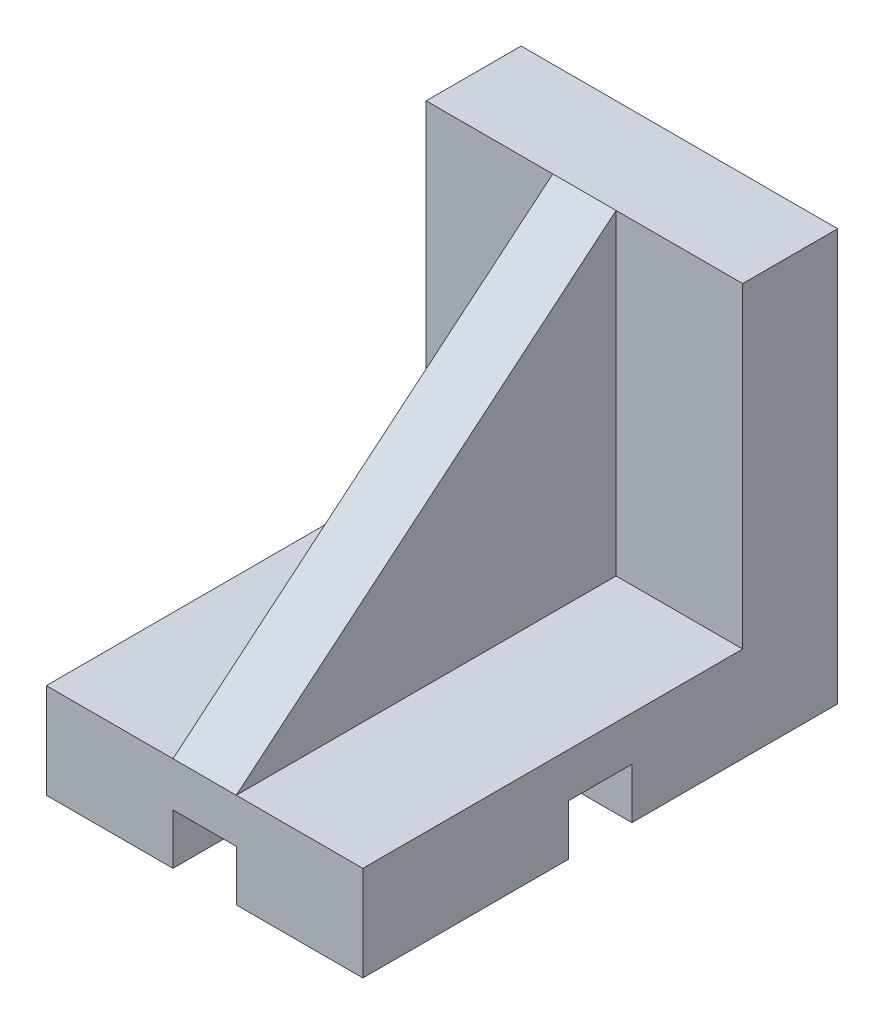
ISO-10303-21;
HEADER;
FILE_DESCRIPTION(('STEP AP214'),'2;1');
FILE_NAME('part.step','',(''),(''),'','','');
FILE_SCHEMA(('AUTOMOTIVE_DESIGN { 1 0 10303 214 1 1 1 1 }'));
ENDSEC;
DATA;
#1=APPLICATION_CONTEXT('core data for automotive mechanical design processes');
#2=APPLICATION_PROTOCOL_DEFINITION('international standard','automotive_design',2000,#1);
#3=PRODUCT_CONTEXT('',#1,'mechanical');
#4=PRODUCT('Part','Part','',(#3));
#5=PRODUCT_RELATED_PRODUCT_CATEGORY('part','',(#4));
#6=PRODUCT_DEFINITION_FORMATION('','',#4);
#7=PRODUCT_DEFINITION_CONTEXT('part definition',#1,'design');
#8=PRODUCT_DEFINITION('design','',#6,#7);
#9=PRODUCT_DEFINITION_SHAPE('','',#8);
#10=(LENGTH_UNIT() NAMED_UNIT(*) SI_UNIT(.MILLI.,.METRE.));
#11=(NAMED_UNIT(*) PLANE_ANGLE_UNIT() SI_UNIT($,.RADIAN.));
#12=(NAMED_UNIT(*) SI_UNIT($,.STERADIAN.) SOLID_ANGLE_UNIT());
#13=UNCERTAINTY_MEASURE_WITH_UNIT(LENGTH_MEASURE(1.E-05),#10,'distance_accuracy_value','');
#14=(GEOMETRIC_REPRESENTATION_CONTEXT(3) GLOBAL_UNCERTAINTY_ASSIGNED_CONTEXT((#13)) GLOBAL_UNIT_ASSIGNED_CONTEXT((#10,
#11,#12)) REPRESENTATION_CONTEXT('',''));
#15=CARTESIAN_POINT('',(0.,0.,0.));
#16=DIRECTION('',(0.,0.,1.));
#17=DIRECTION('',(1.,0.,0.));
#18=AXIS2_PLACEMENT_3D('',#15,#16,#17);
#19=CARTESIAN_POINT('',(0.,0.,0.));
#20=DIRECTION('',(0.,1.,0.));
#21=DIRECTION('',(0.,0.,1.));
#22=AXIS2_PLACEMENT_3D('',#19,#20,#21);
#23=PLANE('',#22);
#24=DIRECTION('',(0.,0.,1.));
#25=VECTOR('',#24,1.);
#26=CARTESIAN_POINT('',(-25.,0.,-37.5));
#27=LINE('',#26,#25);
#28=CARTESIAN_POINT('',(-25.,0.,4.99999999999999));
#29=VERTEX_POINT('',#28);
#30=CARTESIAN_POINT('',(-25.,0.,37.5));
#31=VERTEX_POINT('',#30);
#32=EDGE_CURVE('E192',#29,#31,#27,.T.);
#33=ORIENTED_EDGE('',*,*,#32,.F.);
#34=DIRECTION('',(1.,0.,0.));
#35=VECTOR('',#34,1.);
#36=CARTESIAN_POINT('',(-25.,0.,4.99999999999999));
#37=LINE('',#36,#35);
#38=CARTESIAN_POINT('',(-5.,0.,4.99999999999999));
#39=VERTEX_POINT('',#38);
#40=EDGE_CURVE('E176',#29,#39,#37,.T.);
#41=ORIENTED_EDGE('',*,*,#40,.T.);
#42=DIRECTION('',(0.,0.,1.));
#43=VECTOR('',#42,1.);
#44=CARTESIAN_POINT('',(-5.,0.,-37.5));
#45=LINE('',#44,#43);
#46=CARTESIAN_POINT('',(-5.,0.,37.5));
#47=VERTEX_POINT('',#46);
#48=EDGE_CURVE('E253',#39,#47,#45,.T.);
#49=ORIENTED_EDGE('',*,*,#48,.T.);
#50=DIRECTION('',(1.,0.,0.));
#51=VECTOR('',#50,1.);
#52=CARTESIAN_POINT('',(-25.,0.,37.5));
#53=LINE('',#52,#51);
#54=EDGE_CURVE('E202',#31,#47,#53,.T.);
#55=ORIENTED_EDGE('',*,*,#54,.F.);
#56=EDGE_LOOP('',(#33,#41,#49,#55));
#57=FACE_BOUND('',#56,.T.);
#58=ADVANCED_FACE('F33',(#57),#23,.F.);
#59=DIRECTION('',(0.,0.,1.));
#60=VECTOR('',#59,1.);
#61=CARTESIAN_POINT('',(5.,0.,-37.5));
#62=LINE('',#61,#60);
#63=CARTESIAN_POINT('',(5.,0.,4.99999999999999));
#64=VERTEX_POINT('',#63);
#65=CARTESIAN_POINT('',(5.,0.,37.5));
#66=VERTEX_POINT('',#65);
#67=EDGE_CURVE('E249',#64,#66,#62,.T.);
#68=ORIENTED_EDGE('',*,*,#67,.F.);
#69=CARTESIAN_POINT('',(25.,0.,4.99999999999999));
#70=VERTEX_POINT('',#69);
#71=EDGE_CURVE('E187',#64,#70,#37,.T.);
#72=ORIENTED_EDGE('',*,*,#71,.T.);
#73=DIRECTION('',(0.,0.,-1.));
#74=VECTOR('',#73,1.);
#75=CARTESIAN_POINT('',(25.,0.,-37.5));
#76=LINE('',#75,#74);
#77=CARTESIAN_POINT('',(25.,0.,37.5));
#78=VERTEX_POINT('',#77);
#79=EDGE_CURVE('E304',#78,#70,#76,.T.);
#80=ORIENTED_EDGE('',*,*,#79,.F.);
#81=EDGE_CURVE('E207',#66,#78,#53,.T.);
#82=ORIENTED_EDGE('',*,*,#81,.F.);
#83=EDGE_LOOP('',(#68,#72,#80,#82));
#84=FACE_BOUND('',#83,.T.);
#85=ADVANCED_FACE('F356',(#84),#23,.F.);
#86=CARTESIAN_POINT('',(-5.,0.,-37.5));
#87=DIRECTION('',(-1.,0.,0.));
#88=DIRECTION('',(0.,-1.,0.));
#89=AXIS2_PLACEMENT_3D('',#86,#87,#88);
#90=PLANE('',#89);
#91=ORIENTED_EDGE('',*,*,#48,.F.);
#92=DIRECTION('',(0.,1.,0.));
#93=VECTOR('',#92,1.);
#94=CARTESIAN_POINT('',(-5.,0.,4.99999999999999));
#95=LINE('',#94,#93);
#96=CARTESIAN_POINT('',(-5.,8.,4.99999999999999));
#97=VERTEX_POINT('',#96);
#98=EDGE_CURVE('E182',#39,#97,#95,.T.);
#99=ORIENTED_EDGE('',*,*,#98,.T.);
#100=DIRECTION('',(0.,0.,1.));
#101=VECTOR('',#100,1.);
#102=CARTESIAN_POINT('',(-5.,8.,-37.5));
#103=LINE('',#102,#101);
#104=CARTESIAN_POINT('',(-5.,8.,37.5));
#105=VERTEX_POINT('',#104);
#106=EDGE_CURVE('E241',#97,#105,#103,.T.);
#107=ORIENTED_EDGE('',*,*,#106,.T.);
#108=DIRECTION('',(0.,-1.,0.));
#109=VECTOR('',#108,1.);
#110=CARTESIAN_POINT('',(-5.,0.,37.5));
#111=LINE('',#110,#109);
#112=EDGE_CURVE('E367',#105,#47,#111,.T.);
#113=ORIENTED_EDGE('',*,*,#112,.T.);
#114=EDGE_LOOP('',(#91,#99,#107,#113));
#115=FACE_BOUND('',#114,.T.);
#116=ADVANCED_FACE('F383',(#115),#90,.F.);
#117=CARTESIAN_POINT('',(5.,0.,-37.5));
#118=DIRECTION('',(1.,0.,0.));
#119=DIRECTION('',(0.,1.,0.));
#120=AXIS2_PLACEMENT_3D('',#117,#118,#119);
#121=PLANE('',#120);
#122=DIRECTION('',(0.,0.,1.));
#123=VECTOR('',#122,1.);
#124=CARTESIAN_POINT('',(5.,8.,-37.5));
#125=LINE('',#124,#123);
#126=CARTESIAN_POINT('',(5.,8.,4.99999999999999));
#127=VERTEX_POINT('',#126);
#128=CARTESIAN_POINT('',(5.,8.,37.5));
#129=VERTEX_POINT('',#128);
#130=EDGE_CURVE('E242',#127,#129,#125,.T.);
#131=ORIENTED_EDGE('',*,*,#130,.F.);
#132=DIRECTION('',(0.,-1.,0.));
#133=VECTOR('',#132,1.);
#134=CARTESIAN_POINT('',(5.,0.,4.99999999999999));
#135=LINE('',#134,#133);
#136=EDGE_CURVE('E11',#127,#64,#135,.T.);
#137=ORIENTED_EDGE('',*,*,#136,.T.);
#138=ORIENTED_EDGE('',*,*,#67,.T.);
#139=DIRECTION('',(0.,1.,0.));
#140=VECTOR('',#139,1.);
#141=CARTESIAN_POINT('',(5.,0.,37.5));
#142=LINE('',#141,#140);
#143=EDGE_CURVE('E353',#66,#129,#142,.T.);
#144=ORIENTED_EDGE('',*,*,#143,.T.);
#145=EDGE_LOOP('',(#131,#137,#138,#144));
#146=FACE_BOUND('',#145,.T.);
#147=ADVANCED_FACE('F385',(#146),#121,.F.);
#148=CARTESIAN_POINT('',(-5.,0.,-37.5));
#149=VERTEX_POINT('',#148);
#150=CARTESIAN_POINT('',(-5.,0.,-5.00000000000001));
#151=VERTEX_POINT('',#150);
#152=EDGE_CURVE('E250',#149,#151,#45,.T.);
#153=ORIENTED_EDGE('',*,*,#152,.T.);
#154=DIRECTION('',(1.,0.,0.));
#155=VECTOR('',#154,1.);
#156=CARTESIAN_POINT('',(-25.,0.,-5.00000000000001));
#157=LINE('',#156,#155);
#158=CARTESIAN_POINT('',(-25.,0.,-5.00000000000001));
#159=VERTEX_POINT('',#158);
#160=EDGE_CURVE('E48',#159,#151,#157,.T.);
#161=ORIENTED_EDGE('',*,*,#160,.F.);
#162=CARTESIAN_POINT('',(-25.,0.,-37.5));
#163=VERTEX_POINT('',#162);
#164=EDGE_CURVE('E203',#163,#159,#27,.T.);
#165=ORIENTED_EDGE('',*,*,#164,.F.);
#166=DIRECTION('',(-1.,0.,0.));
#167=VECTOR('',#166,1.);
#168=CARTESIAN_POINT('',(-25.,0.,-37.5));
#169=LINE('',#168,#167);
#170=EDGE_CURVE('E209',#149,#163,#169,.T.);
#171=ORIENTED_EDGE('',*,*,#170,.F.);
#172=EDGE_LOOP('',(#153,#161,#165,#171));
#173=FACE_BOUND('',#172,.T.);
#174=ADVANCED_FACE('F392',(#173),#23,.F.);
#175=CARTESIAN_POINT('',(0.,15.,0.));
#176=DIRECTION('',(0.,1.,0.));
#177=DIRECTION('',(0.,0.,1.));
#178=AXIS2_PLACEMENT_3D('',#175,#176,#177);
#179=PLANE('',#178);
#180=DIRECTION('',(1.,0.,0.));
#181=VECTOR('',#180,1.);
#182=CARTESIAN_POINT('',(-25.,15.,-22.5));
#183=LINE('',#182,#181);
#184=CARTESIAN_POINT('',(5.,15.,-22.5));
#185=VERTEX_POINT('',#184);
#186=CARTESIAN_POINT('',(25.,15.,-22.5));
#187=VERTEX_POINT('',#186);
#188=EDGE_CURVE('E274',#185,#187,#183,.T.);
#189=ORIENTED_EDGE('',*,*,#188,.F.);
#190=DIRECTION('',(0.,0.,-1.));
#191=VECTOR('',#190,1.);
#192=CARTESIAN_POINT('',(5.,15.,37.5));
#193=LINE('',#192,#191);
#194=CARTESIAN_POINT('',(5.,15.,37.5));
#195=VERTEX_POINT('',#194);
#196=EDGE_CURVE('E259',#195,#185,#193,.T.);
#197=ORIENTED_EDGE('',*,*,#196,.F.);
#198=DIRECTION('',(1.,0.,0.));
#199=VECTOR('',#198,1.);
#200=CARTESIAN_POINT('',(-25.,15.,37.5));
#201=LINE('',#200,#199);
#202=CARTESIAN_POINT('',(25.,15.,37.5));
#203=VERTEX_POINT('',#202);
#204=EDGE_CURVE('E302',#195,#203,#201,.T.);
#205=ORIENTED_EDGE('',*,*,#204,.T.);
#206=DIRECTION('',(0.,0.,-1.));
#207=VECTOR('',#206,1.);
#208=CARTESIAN_POINT('',(25.,15.,-37.5));
#209=LINE('',#208,#207);
#210=EDGE_CURVE('E214',#203,#187,#209,.T.);
#211=ORIENTED_EDGE('',*,*,#210,.T.);
#212=EDGE_LOOP('',(#189,#197,#205,#211));
#213=FACE_BOUND('',#212,.T.);
#214=ADVANCED_FACE('F345',(#213),#179,.T.);
#215=CARTESIAN_POINT('',(-25.,65.,-22.5));
#216=DIRECTION('',(0.,0.,-1.));
#217=DIRECTION('',(-1.,0.,0.));
#218=AXIS2_PLACEMENT_3D('',#215,#216,#217);
#219=PLANE('',#218);
#220=DIRECTION('',(0.,1.,0.));
#221=VECTOR('',#220,1.);
#222=CARTESIAN_POINT('',(5.,15.,-22.5));
#223=LINE('',#222,#221);
#224=CARTESIAN_POINT('',(5.,65.,-22.5));
#225=VERTEX_POINT('',#224);
#226=EDGE_CURVE('E254',#185,#225,#223,.T.);
#227=ORIENTED_EDGE('',*,*,#226,.F.);
#228=ORIENTED_EDGE('',*,*,#188,.T.);
#229=DIRECTION('',(0.,-1.,0.));
#230=VECTOR('',#229,1.);
#231=CARTESIAN_POINT('',(25.,65.,-22.5));
#232=LINE('',#231,#230);
#233=CARTESIAN_POINT('',(25.,65.,-22.5));
#234=VERTEX_POINT('',#233);
#235=EDGE_CURVE('E289',#234,#187,#232,.T.);
#236=ORIENTED_EDGE('',*,*,#235,.F.);
#237=DIRECTION('',(1.,0.,0.));
#238=VECTOR('',#237,1.);
#239=CARTESIAN_POINT('',(-25.,65.,-22.5));
#240=LINE('',#239,#238);
#241=EDGE_CURVE('E278',#225,#234,#240,.T.);
#242=ORIENTED_EDGE('',*,*,#241,.F.);
#243=EDGE_LOOP('',(#227,#228,#236,#242));
#244=FACE_BOUND('',#243,.T.);
#245=ADVANCED_FACE('F340',(#244),#219,.F.);
#246=CARTESIAN_POINT('',(25.,15.,-37.5));
#247=DIRECTION('',(-1.,0.,0.));
#248=DIRECTION('',(0.,0.,1.));
#249=AXIS2_PLACEMENT_3D('',#246,#247,#248);
#250=PLANE('',#249);
#251=ORIENTED_EDGE('',*,*,#79,.T.);
#252=DIRECTION('',(0.,-1.,0.));
#253=VECTOR('',#252,1.);
#254=CARTESIAN_POINT('',(25.,0.,4.99999999999999));
#255=LINE('',#254,#253);
#256=CARTESIAN_POINT('',(25.,8.,4.99999999999999));
#257=VERTEX_POINT('',#256);
#258=EDGE_CURVE('E429',#257,#70,#255,.T.);
#259=ORIENTED_EDGE('',*,*,#258,.F.);
#260=DIRECTION('',(0.,0.,1.));
#261=VECTOR('',#260,1.);
#262=CARTESIAN_POINT('',(25.,8.,4.99999999999999));
#263=LINE('',#262,#261);
#264=CARTESIAN_POINT('',(25.,8.,-5.00000000000001));
#265=VERTEX_POINT('',#264);
#266=EDGE_CURVE('E198',#265,#257,#263,.T.);
#267=ORIENTED_EDGE('',*,*,#266,.F.);
#268=DIRECTION('',(0.,1.,0.));
#269=VECTOR('',#268,1.);
#270=CARTESIAN_POINT('',(25.,0.,-5.00000000000001));
#271=LINE('',#270,#269);
#272=CARTESIAN_POINT('',(25.,0.,-5.00000000000001));
#273=VERTEX_POINT('',#272);
#274=EDGE_CURVE('E314',#273,#265,#271,.T.);
#275=ORIENTED_EDGE('',*,*,#274,.F.);
#276=CARTESIAN_POINT('',(25.,0.,-37.5));
#277=VERTEX_POINT('',#276);
#278=EDGE_CURVE('E297',#273,#277,#76,.T.);
#279=ORIENTED_EDGE('',*,*,#278,.T.);
#280=DIRECTION('',(0.,-1.,0.));
#281=VECTOR('',#280,1.);
#282=CARTESIAN_POINT('',(25.,15.,-37.5));
#283=LINE('',#282,#281);
#284=CARTESIAN_POINT('',(25.,65.,-37.5));
#285=VERTEX_POINT('',#284);
#286=EDGE_CURVE('E224',#285,#277,#283,.T.);
#287=ORIENTED_EDGE('',*,*,#286,.F.);
#288=DIRECTION('',(0.,0.,-1.));
#289=VECTOR('',#288,1.);
#290=CARTESIAN_POINT('',(25.,65.,-37.5));
#291=LINE('',#290,#289);
#292=EDGE_CURVE('E283',#234,#285,#291,.T.);
#293=ORIENTED_EDGE('',*,*,#292,.F.);
#294=ORIENTED_EDGE('',*,*,#235,.T.);
#295=ORIENTED_EDGE('',*,*,#210,.F.);
#296=DIRECTION('',(0.,-1.,0.));
#297=VECTOR('',#296,1.);
#298=CARTESIAN_POINT('',(25.,15.,37.5));
#299=LINE('',#298,#297);
#300=EDGE_CURVE('E215',#203,#78,#299,.T.);
#301=ORIENTED_EDGE('',*,*,#300,.T.);
#302=EDGE_LOOP('',(#251,#259,#267,#275,#279,#287,#293,#294,#295,#301));
#303=FACE_BOUND('',#302,.T.);
#304=ADVANCED_FACE('F35',(#303),#250,.F.);
#305=CARTESIAN_POINT('',(-25.,15.,-37.5));
#306=DIRECTION('',(0.,0.,1.));
#307=DIRECTION('',(1.,0.,0.));
#308=AXIS2_PLACEMENT_3D('',#305,#306,#307);
#309=PLANE('',#308);
#310=DIRECTION('',(-1.,0.,0.));
#311=VECTOR('',#310,1.);
#312=CARTESIAN_POINT('',(-5.,8.,-37.5));
#313=LINE('',#312,#311);
#314=CARTESIAN_POINT('',(5.,8.,-37.5));
#315=VERTEX_POINT('',#314);
#316=CARTESIAN_POINT('',(-5.,8.,-37.5));
#317=VERTEX_POINT('',#316);
#318=EDGE_CURVE('E239',#315,#317,#313,.T.);
#319=ORIENTED_EDGE('',*,*,#318,.T.);
#320=DIRECTION('',(0.,-1.,0.));
#321=VECTOR('',#320,1.);
#322=CARTESIAN_POINT('',(-5.,0.,-37.5));
#323=LINE('',#322,#321);
#324=EDGE_CURVE('E368',#317,#149,#323,.T.);
#325=ORIENTED_EDGE('',*,*,#324,.T.);
#326=ORIENTED_EDGE('',*,*,#170,.T.);
#327=DIRECTION('',(0.,-1.,0.));
#328=VECTOR('',#327,1.);
#329=CARTESIAN_POINT('',(-25.,15.,-37.5));
#330=LINE('',#329,#328);
#331=CARTESIAN_POINT('',(-25.,65.,-37.5));
#332=VERTEX_POINT('',#331);
#333=EDGE_CURVE('E221',#332,#163,#330,.T.);
#334=ORIENTED_EDGE('',*,*,#333,.F.);
#335=DIRECTION('',(-1.,0.,0.));
#336=VECTOR('',#335,1.);
#337=CARTESIAN_POINT('',(-25.,65.,-37.5));
#338=LINE('',#337,#336);
#339=EDGE_CURVE('E286',#285,#332,#338,.T.);
#340=ORIENTED_EDGE('',*,*,#339,.F.);
#341=ORIENTED_EDGE('',*,*,#286,.T.);
#342=CARTESIAN_POINT('',(5.,0.,-37.5));
#343=VERTEX_POINT('',#342);
#344=EDGE_CURVE('E204',#277,#343,#169,.T.);
#345=ORIENTED_EDGE('',*,*,#344,.T.);
#346=DIRECTION('',(0.,1.,0.));
#347=VECTOR('',#346,1.);
#348=CARTESIAN_POINT('',(5.,0.,-37.5));
#349=LINE('',#348,#347);
#350=EDGE_CURVE('E371',#343,#315,#349,.T.);
#351=ORIENTED_EDGE('',*,*,#350,.T.);
#352=EDGE_LOOP('',(#319,#325,#326,#334,#340,#341,#345,#351));
#353=FACE_BOUND('',#352,.T.);
#354=ADVANCED_FACE('F319',(#353),#309,.F.);
#355=CARTESIAN_POINT('',(-25.,15.,-37.5));
#356=DIRECTION('',(1.,0.,0.));
#357=DIRECTION('',(0.,0.,-1.));
#358=AXIS2_PLACEMENT_3D('',#355,#356,#357);
#359=PLANE('',#358);
#360=DIRECTION('',(0.,0.,1.));
#361=VECTOR('',#360,1.);
#362=CARTESIAN_POINT('',(-25.,8.,4.99999999999999));
#363=LINE('',#362,#361);
#364=CARTESIAN_POINT('',(-25.,8.,-5.00000000000001));
#365=VERTEX_POINT('',#364);
#366=CARTESIAN_POINT('',(-25.,8.,4.99999999999999));
#367=VERTEX_POINT('',#366);
#368=EDGE_CURVE('E196',#365,#367,#363,.T.);
#369=ORIENTED_EDGE('',*,*,#368,.T.);
#370=DIRECTION('',(0.,-1.,0.));
#371=VECTOR('',#370,1.);
#372=CARTESIAN_POINT('',(-25.,0.,4.99999999999999));
#373=LINE('',#372,#371);
#374=EDGE_CURVE('E179',#367,#29,#373,.T.);
#375=ORIENTED_EDGE('',*,*,#374,.T.);
#376=ORIENTED_EDGE('',*,*,#32,.T.);
#377=DIRECTION('',(0.,-1.,0.));
#378=VECTOR('',#377,1.);
#379=CARTESIAN_POINT('',(-25.,15.,37.5));
#380=LINE('',#379,#378);
#381=CARTESIAN_POINT('',(-25.,15.,37.5));
#382=VERTEX_POINT('',#381);
#383=EDGE_CURVE('E218',#382,#31,#380,.T.);
#384=ORIENTED_EDGE('',*,*,#383,.F.);
#385=DIRECTION('',(0.,0.,1.));
#386=VECTOR('',#385,1.);
#387=CARTESIAN_POINT('',(-25.,15.,-37.5));
#388=LINE('',#387,#386);
#389=CARTESIAN_POINT('',(-25.,15.,-22.5));
#390=VERTEX_POINT('',#389);
#391=EDGE_CURVE('E300',#390,#382,#388,.T.);
#392=ORIENTED_EDGE('',*,*,#391,.F.);
#393=DIRECTION('',(0.,-1.,0.));
#394=VECTOR('',#393,1.);
#395=CARTESIAN_POINT('',(-25.,65.,-22.5));
#396=LINE('',#395,#394);
#397=CARTESIAN_POINT('',(-25.,65.,-22.5));
#398=VERTEX_POINT('',#397);
#399=EDGE_CURVE('E294',#398,#390,#396,.T.);
#400=ORIENTED_EDGE('',*,*,#399,.F.);
#401=DIRECTION('',(0.,0.,1.));
#402=VECTOR('',#401,1.);
#403=CARTESIAN_POINT('',(-25.,65.,-37.5));
#404=LINE('',#403,#402);
#405=EDGE_CURVE('E275',#332,#398,#404,.T.);
#406=ORIENTED_EDGE('',*,*,#405,.F.);
#407=ORIENTED_EDGE('',*,*,#333,.T.);
#408=ORIENTED_EDGE('',*,*,#164,.T.);
#409=DIRECTION('',(0.,1.,0.));
#410=VECTOR('',#409,1.);
#411=CARTESIAN_POINT('',(-25.,0.,-5.00000000000001));
#412=LINE('',#411,#410);
#413=EDGE_CURVE('E197',#159,#365,#412,.T.);
#414=ORIENTED_EDGE('',*,*,#413,.T.);
#415=EDGE_LOOP('',(#369,#375,#376,#384,#392,#400,#406,#407,#408,#414));
#416=FACE_BOUND('',#415,.T.);
#417=ADVANCED_FACE('F190',(#416),#359,.F.);
#418=CARTESIAN_POINT('',(-25.,15.,37.5));
#419=DIRECTION('',(0.,0.,-1.));
#420=DIRECTION('',(-1.,0.,0.));
#421=AXIS2_PLACEMENT_3D('',#418,#419,#420);
#422=PLANE('',#421);
#423=ORIENTED_EDGE('',*,*,#54,.T.);
#424=ORIENTED_EDGE('',*,*,#112,.F.);
#425=DIRECTION('',(-1.,0.,0.));
#426=VECTOR('',#425,1.);
#427=CARTESIAN_POINT('',(-5.,8.,37.5));
#428=LINE('',#427,#426);
#429=EDGE_CURVE('E372',#129,#105,#428,.T.);
#430=ORIENTED_EDGE('',*,*,#429,.F.);
#431=ORIENTED_EDGE('',*,*,#143,.F.);
#432=ORIENTED_EDGE('',*,*,#81,.T.);
#433=ORIENTED_EDGE('',*,*,#300,.F.);
#434=ORIENTED_EDGE('',*,*,#204,.F.);
#435=DIRECTION('',(-1.,0.,0.));
#436=VECTOR('',#435,1.);
#437=CARTESIAN_POINT('',(5.,15.,37.5));
#438=LINE('',#437,#436);
#439=CARTESIAN_POINT('',(-5.,15.,37.5));
#440=VERTEX_POINT('',#439);
#441=EDGE_CURVE('E261',#195,#440,#438,.T.);
#442=ORIENTED_EDGE('',*,*,#441,.T.);
#443=EDGE_CURVE('E219',#382,#440,#201,.T.);
#444=ORIENTED_EDGE('',*,*,#443,.F.);
#445=ORIENTED_EDGE('',*,*,#383,.T.);
#446=EDGE_LOOP('',(#423,#424,#430,#431,#432,#433,#434,#442,#444,#445));
#447=FACE_BOUND('',#446,.T.);
#448=ADVANCED_FACE('F348',(#447),#422,.F.);
#449=DIRECTION('',(0.,0.,-1.));
#450=VECTOR('',#449,1.);
#451=CARTESIAN_POINT('',(-5.,15.,37.5));
#452=LINE('',#451,#450);
#453=CARTESIAN_POINT('',(-5.,15.,-22.5));
#454=VERTEX_POINT('',#453);
#455=EDGE_CURVE('E257',#440,#454,#452,.T.);
#456=ORIENTED_EDGE('',*,*,#455,.T.);
#457=EDGE_CURVE('E279',#390,#454,#183,.T.);
#458=ORIENTED_EDGE('',*,*,#457,.F.);
#459=ORIENTED_EDGE('',*,*,#391,.T.);
#460=ORIENTED_EDGE('',*,*,#443,.T.);
#461=EDGE_LOOP('',(#456,#458,#459,#460));
#462=FACE_BOUND('',#461,.T.);
#463=ADVANCED_FACE('F406',(#462),#179,.T.);
#464=ORIENTED_EDGE('',*,*,#278,.F.);
#465=CARTESIAN_POINT('',(5.,0.,-5.00000000000001));
#466=VERTEX_POINT('',#465);
#467=EDGE_CURVE('E186',#466,#273,#157,.T.);
#468=ORIENTED_EDGE('',*,*,#467,.F.);
#469=EDGE_CURVE('E233',#343,#466,#62,.T.);
#470=ORIENTED_EDGE('',*,*,#469,.F.);
#471=ORIENTED_EDGE('',*,*,#344,.F.);
#472=EDGE_LOOP('',(#464,#468,#470,#471));
#473=FACE_BOUND('',#472,.T.);
#474=ADVANCED_FACE('F316',(#473),#23,.F.);
#475=ORIENTED_EDGE('',*,*,#457,.T.);
#476=DIRECTION('',(0.,1.,0.));
#477=VECTOR('',#476,1.);
#478=CARTESIAN_POINT('',(-5.,15.,-22.5));
#479=LINE('',#478,#477);
#480=CARTESIAN_POINT('',(-5.,65.,-22.5));
#481=VERTEX_POINT('',#480);
#482=EDGE_CURVE('E262',#454,#481,#479,.T.);
#483=ORIENTED_EDGE('',*,*,#482,.T.);
#484=EDGE_CURVE('E280',#398,#481,#240,.T.);
#485=ORIENTED_EDGE('',*,*,#484,.F.);
#486=ORIENTED_EDGE('',*,*,#399,.T.);
#487=EDGE_LOOP('',(#475,#483,#485,#486));
#488=FACE_BOUND('',#487,.T.);
#489=ADVANCED_FACE('F327',(#488),#219,.F.);
#490=CARTESIAN_POINT('',(0.,65.,0.));
#491=DIRECTION('',(0.,1.,0.));
#492=DIRECTION('',(0.,0.,1.));
#493=AXIS2_PLACEMENT_3D('',#490,#491,#492);
#494=PLANE('',#493);
#495=ORIENTED_EDGE('',*,*,#405,.T.);
#496=ORIENTED_EDGE('',*,*,#484,.T.);
#497=DIRECTION('',(-1.,0.,0.));
#498=VECTOR('',#497,1.);
#499=CARTESIAN_POINT('',(5.,65.,-22.5));
#500=LINE('',#499,#498);
#501=EDGE_CURVE('E271',#225,#481,#500,.T.);
#502=ORIENTED_EDGE('',*,*,#501,.F.);
#503=ORIENTED_EDGE('',*,*,#241,.T.);
#504=ORIENTED_EDGE('',*,*,#292,.T.);
#505=ORIENTED_EDGE('',*,*,#339,.T.);
#506=EDGE_LOOP('',(#495,#496,#502,#503,#504,#505));
#507=FACE_BOUND('',#506,.T.);
#508=ADVANCED_FACE('F322',(#507),#494,.T.);
#509=CARTESIAN_POINT('',(5.,65.,-22.5));
#510=DIRECTION('',(0.,-0.768221279597376,-0.64018439966448));
#511=DIRECTION('',(0.,0.64018439966448,-0.768221279597376));
#512=AXIS2_PLACEMENT_3D('',#509,#510,#511);
#513=PLANE('',#512);
#514=DIRECTION('',(0.,-0.64018439966448,0.768221279597376));
#515=VECTOR('',#514,1.);
#516=CARTESIAN_POINT('',(-5.,65.,-22.5));
#517=LINE('',#516,#515);
#518=EDGE_CURVE('E265',#481,#440,#517,.T.);
#519=ORIENTED_EDGE('',*,*,#518,.T.);
#520=ORIENTED_EDGE('',*,*,#441,.F.);
#521=DIRECTION('',(0.,-0.64018439966448,0.768221279597376));
#522=VECTOR('',#521,1.);
#523=CARTESIAN_POINT('',(5.,65.,-22.5));
#524=LINE('',#523,#522);
#525=EDGE_CURVE('E256',#225,#195,#524,.T.);
#526=ORIENTED_EDGE('',*,*,#525,.F.);
#527=ORIENTED_EDGE('',*,*,#501,.T.);
#528=EDGE_LOOP('',(#519,#520,#526,#527));
#529=FACE_BOUND('',#528,.T.);
#530=ADVANCED_FACE('F333',(#529),#513,.F.);
#531=CARTESIAN_POINT('',(5.,0.,0.));
#532=DIRECTION('',(-1.,0.,0.));
#533=DIRECTION('',(0.,0.,1.));
#534=AXIS2_PLACEMENT_3D('',#531,#532,#533);
#535=PLANE('',#534);
#536=ORIENTED_EDGE('',*,*,#226,.T.);
#537=ORIENTED_EDGE('',*,*,#525,.T.);
#538=ORIENTED_EDGE('',*,*,#196,.T.);
#539=EDGE_LOOP('',(#536,#537,#538));
#540=FACE_BOUND('',#539,.T.);
#541=ADVANCED_FACE('F543',(#540),#535,.F.);
#542=CARTESIAN_POINT('',(-5.,0.,0.));
#543=DIRECTION('',(-1.,0.,0.));
#544=DIRECTION('',(0.,0.,1.));
#545=AXIS2_PLACEMENT_3D('',#542,#543,#544);
#546=PLANE('',#545);
#547=ORIENTED_EDGE('',*,*,#482,.F.);
#548=ORIENTED_EDGE('',*,*,#455,.F.);
#549=ORIENTED_EDGE('',*,*,#518,.F.);
#550=EDGE_LOOP('',(#547,#548,#549));
#551=FACE_BOUND('',#550,.T.);
#552=ADVANCED_FACE('F398',(#551),#546,.T.);
#553=CARTESIAN_POINT('',(-5.,8.,-5.00000000000001));
#554=VERTEX_POINT('',#553);
#555=EDGE_CURVE('E244',#317,#554,#103,.T.);
#556=ORIENTED_EDGE('',*,*,#555,.T.);
#557=DIRECTION('',(0.,-1.,0.));
#558=VECTOR('',#557,1.);
#559=CARTESIAN_POINT('',(-5.,0.,-5.00000000000001));
#560=LINE('',#559,#558);
#561=EDGE_CURVE('E363',#554,#151,#560,.T.);
#562=ORIENTED_EDGE('',*,*,#561,.T.);
#563=ORIENTED_EDGE('',*,*,#152,.F.);
#564=ORIENTED_EDGE('',*,*,#324,.F.);
#565=EDGE_LOOP('',(#556,#562,#563,#564));
#566=FACE_BOUND('',#565,.T.);
#567=ADVANCED_FACE('F387',(#566),#90,.F.);
#568=CARTESIAN_POINT('',(-5.,8.,-37.5));
#569=DIRECTION('',(0.,1.,0.));
#570=DIRECTION('',(0.,0.,1.));
#571=AXIS2_PLACEMENT_3D('',#568,#569,#570);
#572=PLANE('',#571);
#573=CARTESIAN_POINT('',(5.,8.,-5.00000000000001));
#574=VERTEX_POINT('',#573);
#575=EDGE_CURVE('E230',#315,#574,#125,.T.);
#576=ORIENTED_EDGE('',*,*,#575,.T.);
#577=DIRECTION('',(1.,0.,0.));
#578=VECTOR('',#577,1.);
#579=CARTESIAN_POINT('',(-25.,8.,-5.00000000000001));
#580=LINE('',#579,#578);
#581=EDGE_CURVE('E56',#574,#265,#580,.T.);
#582=ORIENTED_EDGE('',*,*,#581,.T.);
#583=ORIENTED_EDGE('',*,*,#266,.T.);
#584=DIRECTION('',(1.,0.,0.));
#585=VECTOR('',#584,1.);
#586=CARTESIAN_POINT('',(-25.,8.,4.99999999999999));
#587=LINE('',#586,#585);
#588=EDGE_CURVE('E424',#127,#257,#587,.T.);
#589=ORIENTED_EDGE('',*,*,#588,.F.);
#590=ORIENTED_EDGE('',*,*,#130,.T.);
#591=ORIENTED_EDGE('',*,*,#429,.T.);
#592=ORIENTED_EDGE('',*,*,#106,.F.);
#593=EDGE_CURVE('E365',#367,#97,#587,.T.);
#594=ORIENTED_EDGE('',*,*,#593,.F.);
#595=ORIENTED_EDGE('',*,*,#368,.F.);
#596=EDGE_CURVE('E423',#365,#554,#580,.T.);
#597=ORIENTED_EDGE('',*,*,#596,.T.);
#598=ORIENTED_EDGE('',*,*,#555,.F.);
#599=ORIENTED_EDGE('',*,*,#318,.F.);
#600=EDGE_LOOP('',(#576,#582,#583,#589,#590,#591,#592,#594,#595,#597,#598,#599));
#601=FACE_BOUND('',#600,.T.);
#602=ADVANCED_FACE('F236',(#601),#572,.F.);
#603=ORIENTED_EDGE('',*,*,#469,.T.);
#604=DIRECTION('',(0.,1.,0.));
#605=VECTOR('',#604,1.);
#606=CARTESIAN_POINT('',(5.,0.,-5.00000000000001));
#607=LINE('',#606,#605);
#608=EDGE_CURVE('E41',#466,#574,#607,.T.);
#609=ORIENTED_EDGE('',*,*,#608,.T.);
#610=ORIENTED_EDGE('',*,*,#575,.F.);
#611=ORIENTED_EDGE('',*,*,#350,.F.);
#612=EDGE_LOOP('',(#603,#609,#610,#611));
#613=FACE_BOUND('',#612,.T.);
#614=ADVANCED_FACE('F229',(#613),#121,.F.);
#615=CARTESIAN_POINT('',(-25.,0.,-5.00000000000001));
#616=DIRECTION('',(0.,0.,-1.));
#617=DIRECTION('',(-1.,0.,0.));
#618=AXIS2_PLACEMENT_3D('',#615,#616,#617);
#619=PLANE('',#618);
#620=ORIENTED_EDGE('',*,*,#467,.T.);
#621=ORIENTED_EDGE('',*,*,#274,.T.);
#622=ORIENTED_EDGE('',*,*,#581,.F.);
#623=ORIENTED_EDGE('',*,*,#608,.F.);
#624=EDGE_LOOP('',(#620,#621,#622,#623));
#625=FACE_BOUND('',#624,.T.);
#626=ADVANCED_FACE('F433',(#625),#619,.F.);
#627=CARTESIAN_POINT('',(-25.,0.,4.99999999999999));
#628=DIRECTION('',(0.,0.,1.));
#629=DIRECTION('',(1.,0.,0.));
#630=AXIS2_PLACEMENT_3D('',#627,#628,#629);
#631=PLANE('',#630);
#632=ORIENTED_EDGE('',*,*,#588,.T.);
#633=ORIENTED_EDGE('',*,*,#258,.T.);
#634=ORIENTED_EDGE('',*,*,#71,.F.);
#635=ORIENTED_EDGE('',*,*,#136,.F.);
#636=EDGE_LOOP('',(#632,#633,#634,#635));
#637=FACE_BOUND('',#636,.T.);
#638=ADVANCED_FACE('F431',(#637),#631,.F.);
#639=ORIENTED_EDGE('',*,*,#40,.F.);
#640=ORIENTED_EDGE('',*,*,#374,.F.);
#641=ORIENTED_EDGE('',*,*,#593,.T.);
#642=ORIENTED_EDGE('',*,*,#98,.F.);
#643=EDGE_LOOP('',(#639,#640,#641,#642));
#644=FACE_BOUND('',#643,.T.);
#645=ADVANCED_FACE('F178',(#644),#631,.F.);
#646=ORIENTED_EDGE('',*,*,#596,.F.);
#647=ORIENTED_EDGE('',*,*,#413,.F.);
#648=ORIENTED_EDGE('',*,*,#160,.T.);
#649=ORIENTED_EDGE('',*,*,#561,.F.);
#650=EDGE_LOOP('',(#646,#647,#648,#649));
#651=FACE_BOUND('',#650,.T.);
#652=ADVANCED_FACE('F422',(#651),#619,.F.);
#653=CLOSED_SHELL('',(#58,#85,#116,#147,#174,#214,#245,#304,#354,#417,#448,#463,#474,#489,#508,
#530,#541,#552,#567,#602,#614,#626,#638,#645,#652));
#654=MANIFOLD_SOLID_BREP('B2',#653);
#655=ADVANCED_BREP_SHAPE_REPRESENTATION('',(#18,#654),#14);
#656=SHAPE_DEFINITION_REPRESENTATION(#9,#655);
ENDSEC;
END-ISO-10303-21;
